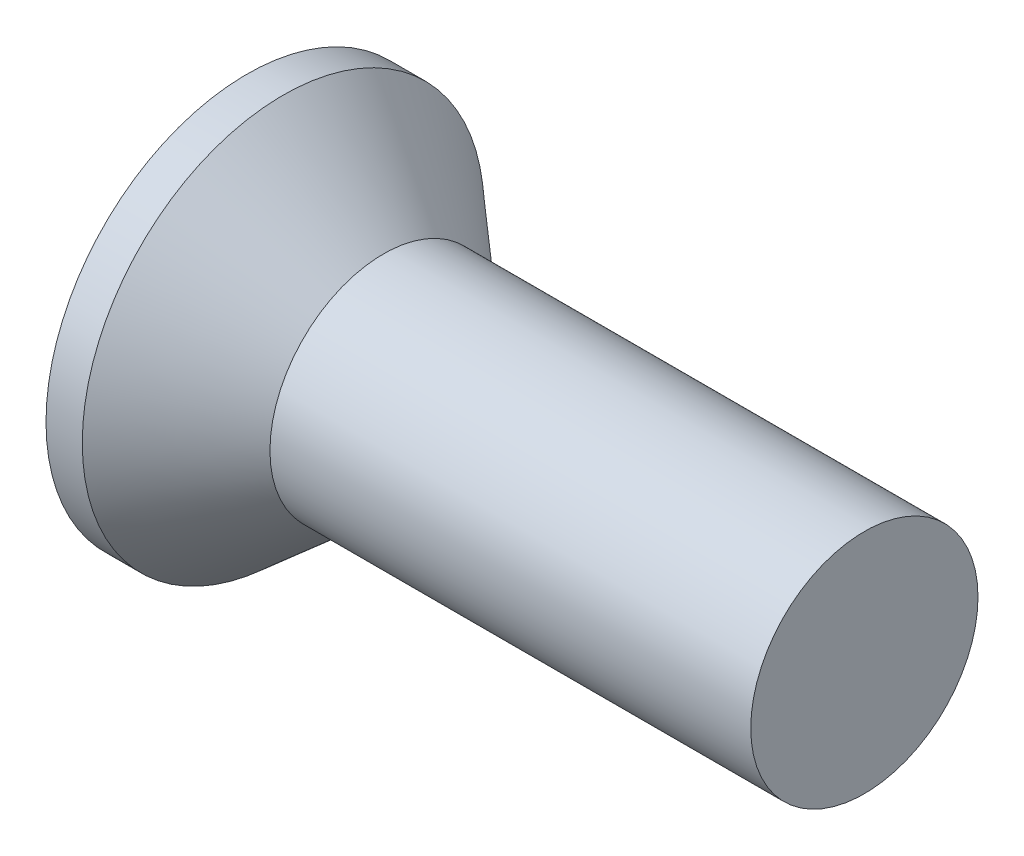
ISO-10303-21;
HEADER;
FILE_DESCRIPTION(('STEP AP214'),'2;1');
FILE_NAME('part.step','',(''),(''),'','','');
FILE_SCHEMA(('AUTOMOTIVE_DESIGN { 1 0 10303 214 1 1 1 1 }'));
ENDSEC;
DATA;
#1=APPLICATION_CONTEXT('core data for automotive mechanical design processes');
#2=APPLICATION_PROTOCOL_DEFINITION('international standard','automotive_design',2000,#1);
#3=PRODUCT_CONTEXT('',#1,'mechanical');
#4=PRODUCT('Part','Part','',(#3));
#5=PRODUCT_RELATED_PRODUCT_CATEGORY('part','',(#4));
#6=PRODUCT_DEFINITION_FORMATION('','',#4);
#7=PRODUCT_DEFINITION_CONTEXT('part definition',#1,'design');
#8=PRODUCT_DEFINITION('design','',#6,#7);
#9=PRODUCT_DEFINITION_SHAPE('','',#8);
#10=(LENGTH_UNIT() NAMED_UNIT(*) SI_UNIT(.MILLI.,.METRE.));
#11=(NAMED_UNIT(*) PLANE_ANGLE_UNIT() SI_UNIT($,.RADIAN.));
#12=(NAMED_UNIT(*) SI_UNIT($,.STERADIAN.) SOLID_ANGLE_UNIT());
#13=UNCERTAINTY_MEASURE_WITH_UNIT(LENGTH_MEASURE(1.E-05),#10,'distance_accuracy_value','');
#14=(GEOMETRIC_REPRESENTATION_CONTEXT(3) GLOBAL_UNCERTAINTY_ASSIGNED_CONTEXT((#13)) GLOBAL_UNIT_ASSIGNED_CONTEXT((#10,
#11,#12)) REPRESENTATION_CONTEXT('',''));
#15=CARTESIAN_POINT('',(0.,0.,0.));
#16=DIRECTION('',(0.,0.,1.));
#17=DIRECTION('',(1.,0.,0.));
#18=AXIS2_PLACEMENT_3D('',#15,#16,#17);
#19=CARTESIAN_POINT('',(0.,0.,0.));
#20=DIRECTION('',(-1.,0.,0.));
#21=DIRECTION('',(0.,0.,1.));
#22=AXIS2_PLACEMENT_3D('',#19,#20,#21);
#23=PLANE('',#22);
#24=CARTESIAN_POINT('',(0.,0.,0.));
#25=DIRECTION('',(-1.,0.,0.));
#26=DIRECTION('',(0.,0.,1.));
#27=AXIS2_PLACEMENT_3D('',#24,#25,#26);
#28=CIRCLE('',#27,3.0988);
#29=CARTESIAN_POINT('',(0.,0.,3.0988));
#30=VERTEX_POINT('',#29);
#31=EDGE_CURVE('E39',#30,#30,#28,.T.);
#32=ORIENTED_EDGE('',*,*,#31,.T.);
#33=EDGE_LOOP('',(#32));
#34=FACE_BOUND('',#33,.T.);
#35=DIRECTION('',(0.,1.,0.));
#36=VECTOR('',#35,1.);
#37=CARTESIAN_POINT('',(0.,-2.4765,-0.482599999999999));
#38=LINE('',#37,#36);
#39=CARTESIAN_POINT('',(0.,-2.4765,-0.482599999999999));
#40=VERTEX_POINT('',#39);
#41=CARTESIAN_POINT('',(0.,-0.482599999999998,-0.482599999999999));
#42=VERTEX_POINT('',#41);
#43=EDGE_CURVE('E100',#40,#42,#38,.T.);
#44=ORIENTED_EDGE('',*,*,#43,.T.);
#45=DIRECTION('',(0.,0.,-1.));
#46=VECTOR('',#45,1.);
#47=CARTESIAN_POINT('',(0.,-0.482600000000008,2.4765));
#48=LINE('',#47,#46);
#49=CARTESIAN_POINT('',(0.,-0.482599999999991,-2.4765));
#50=VERTEX_POINT('',#49);
#51=EDGE_CURVE('E80',#42,#50,#48,.T.);
#52=ORIENTED_EDGE('',*,*,#51,.T.);
#53=DIRECTION('',(0.,1.,0.));
#54=VECTOR('',#53,1.);
#55=CARTESIAN_POINT('',(0.,-0.482599999999991,-2.4765));
#56=LINE('',#55,#54);
#57=CARTESIAN_POINT('',(0.,0.482600000000008,-2.4765));
#58=VERTEX_POINT('',#57);
#59=EDGE_CURVE('E335',#50,#58,#56,.T.);
#60=ORIENTED_EDGE('',*,*,#59,.T.);
#61=DIRECTION('',(0.,0.,1.));
#62=VECTOR('',#61,1.);
#63=CARTESIAN_POINT('',(0.,0.482600000000008,-2.4765));
#64=LINE('',#63,#62);
#65=CARTESIAN_POINT('',(0.,0.482600000000001,-0.482599999999999));
#66=VERTEX_POINT('',#65);
#67=EDGE_CURVE('E96',#58,#66,#64,.T.);
#68=ORIENTED_EDGE('',*,*,#67,.T.);
#69=CARTESIAN_POINT('',(0.,2.4765,-0.482599999999999));
#70=VERTEX_POINT('',#69);
#71=EDGE_CURVE('E90',#66,#70,#38,.T.);
#72=ORIENTED_EDGE('',*,*,#71,.T.);
#73=DIRECTION('',(0.,0.,1.));
#74=VECTOR('',#73,1.);
#75=CARTESIAN_POINT('',(0.,2.4765,-0.482599999999999));
#76=LINE('',#75,#74);
#77=CARTESIAN_POINT('',(0.,2.4765,0.482599999999999));
#78=VERTEX_POINT('',#77);
#79=EDGE_CURVE('E93',#70,#78,#76,.T.);
#80=ORIENTED_EDGE('',*,*,#79,.T.);
#81=DIRECTION('',(0.,-1.,0.));
#82=VECTOR('',#81,1.);
#83=CARTESIAN_POINT('',(0.,2.4765,0.482599999999999));
#84=LINE('',#83,#82);
#85=CARTESIAN_POINT('',(0.,0.482599999999997,0.4826));
#86=VERTEX_POINT('',#85);
#87=EDGE_CURVE('E347',#78,#86,#84,.T.);
#88=ORIENTED_EDGE('',*,*,#87,.T.);
#89=CARTESIAN_POINT('',(0.,0.48259999999999,2.4765));
#90=VERTEX_POINT('',#89);
#91=EDGE_CURVE('E330',#86,#90,#64,.T.);
#92=ORIENTED_EDGE('',*,*,#91,.T.);
#93=DIRECTION('',(0.,-1.,0.));
#94=VECTOR('',#93,1.);
#95=CARTESIAN_POINT('',(0.,0.48259999999999,2.4765));
#96=LINE('',#95,#94);
#97=CARTESIAN_POINT('',(0.,-0.482600000000008,2.4765));
#98=VERTEX_POINT('',#97);
#99=EDGE_CURVE('E316',#90,#98,#96,.T.);
#100=ORIENTED_EDGE('',*,*,#99,.T.);
#101=CARTESIAN_POINT('',(0.,-0.482600000000001,0.4826));
#102=VERTEX_POINT('',#101);
#103=EDGE_CURVE('E328',#98,#102,#48,.T.);
#104=ORIENTED_EDGE('',*,*,#103,.T.);
#105=CARTESIAN_POINT('',(0.,-2.4765,0.4826));
#106=VERTEX_POINT('',#105);
#107=EDGE_CURVE('E106',#102,#106,#84,.T.);
#108=ORIENTED_EDGE('',*,*,#107,.T.);
#109=DIRECTION('',(0.,0.,-1.));
#110=VECTOR('',#109,1.);
#111=CARTESIAN_POINT('',(0.,-2.4765,0.4826));
#112=LINE('',#111,#110);
#113=EDGE_CURVE('E129',#106,#40,#112,.T.);
#114=ORIENTED_EDGE('',*,*,#113,.T.);
#115=EDGE_LOOP('',(#44,#52,#60,#68,#72,#80,#88,#92,#100,#104,#108,#114));
#116=FACE_BOUND('',#115,.T.);
#117=ADVANCED_FACE('F32',(#34,#116),#23,.T.);
#118=CARTESIAN_POINT('',(3.18005113636364,0.,0.215250568181818));
#119=DIRECTION('',(-0.08377526021447,0.,-0.996484674130013));
#120=DIRECTION('',(-0.996484674130013,0.,0.08377526021447));
#121=AXIS2_PLACEMENT_3D('',#118,#119,#120);
#122=PLANE('',#121);
#123=ORIENTED_EDGE('',*,*,#107,.F.);
#124=DIRECTION('',(0.993006162058238,0.0834828189340999,-0.0834828189340996));
#125=VECTOR('',#124,1.);
#126=CARTESIAN_POINT('',(3.19789518323365,-0.213750404949385,0.213750404949384));
#127=LINE('',#126,#125);
#128=CARTESIAN_POINT('',(2.8702,-0.241300000000001,0.241299999999999));
#129=VERTEX_POINT('',#128);
#130=EDGE_CURVE('E124',#102,#129,#127,.T.);
#131=ORIENTED_EDGE('',*,*,#130,.T.);
#132=DIRECTION('',(0.78724620786628,0.613076692851616,-0.0661844157055722));
#133=VECTOR('',#132,1.);
#134=CARTESIAN_POINT('',(0.,-2.4765,0.4826));
#135=LINE('',#134,#133);
#136=EDGE_CURVE('E101',#106,#129,#135,.T.);
#137=ORIENTED_EDGE('',*,*,#136,.F.);
#138=EDGE_LOOP('',(#123,#131,#137));
#139=FACE_BOUND('',#138,.T.);
#140=ADVANCED_FACE('F152',(#139),#122,.T.);
#141=DIRECTION('',(0.78724620786628,-0.613076692851616,-0.066184415705572));
#142=VECTOR('',#141,1.);
#143=CARTESIAN_POINT('',(0.,2.4765,0.482599999999999));
#144=LINE('',#143,#142);
#145=CARTESIAN_POINT('',(2.8702,0.2413,0.2413));
#146=VERTEX_POINT('',#145);
#147=EDGE_CURVE('E46',#78,#146,#144,.T.);
#148=ORIENTED_EDGE('',*,*,#147,.T.);
#149=DIRECTION('',(-0.993006162058238,0.0834828189340991,0.0834828189340996));
#150=VECTOR('',#149,1.);
#151=CARTESIAN_POINT('',(3.19789518323365,0.213750404949383,0.213750404949384));
#152=LINE('',#151,#150);
#153=EDGE_CURVE('E343',#146,#86,#152,.T.);
#154=ORIENTED_EDGE('',*,*,#153,.T.);
#155=ORIENTED_EDGE('',*,*,#87,.F.);
#156=EDGE_LOOP('',(#148,#154,#155));
#157=FACE_BOUND('',#156,.T.);
#158=ADVANCED_FACE('F156',(#157),#122,.T.);
#159=CARTESIAN_POINT('',(3.18005113636364,0.,-0.215250568181818));
#160=DIRECTION('',(-0.0837752602144698,0.,0.996484674130013));
#161=DIRECTION('',(0.996484674130013,0.,0.0837752602144698));
#162=AXIS2_PLACEMENT_3D('',#159,#160,#161);
#163=PLANE('',#162);
#164=DIRECTION('',(0.78724620786628,0.613076692851616,0.0661844157055719));
#165=VECTOR('',#164,1.);
#166=CARTESIAN_POINT('',(0.,-2.4765,-0.482599999999999));
#167=LINE('',#166,#165);
#168=CARTESIAN_POINT('',(2.8702,-0.241299999999999,-0.241300000000001));
#169=VERTEX_POINT('',#168);
#170=EDGE_CURVE('E55',#40,#169,#167,.T.);
#171=ORIENTED_EDGE('',*,*,#170,.T.);
#172=DIRECTION('',(-0.993006162058238,-0.0834828189340993,-0.0834828189340994));
#173=VECTOR('',#172,1.);
#174=CARTESIAN_POINT('',(3.19789518323364,-0.213750404949383,-0.213750404949384));
#175=LINE('',#174,#173);
#176=EDGE_CURVE('E11',#169,#42,#175,.T.);
#177=ORIENTED_EDGE('',*,*,#176,.T.);
#178=ORIENTED_EDGE('',*,*,#43,.F.);
#179=EDGE_LOOP('',(#171,#177,#178));
#180=FACE_BOUND('',#179,.T.);
#181=ADVANCED_FACE('F149',(#180),#163,.T.);
#182=ORIENTED_EDGE('',*,*,#71,.F.);
#183=DIRECTION('',(0.993006162058238,-0.0834828189340997,0.0834828189340994));
#184=VECTOR('',#183,1.);
#185=CARTESIAN_POINT('',(3.19789518323364,0.213750404949385,-0.213750404949384));
#186=LINE('',#185,#184);
#187=CARTESIAN_POINT('',(2.8702,0.2413,-0.2413));
#188=VERTEX_POINT('',#187);
#189=EDGE_CURVE('E109',#66,#188,#186,.T.);
#190=ORIENTED_EDGE('',*,*,#189,.T.);
#191=DIRECTION('',(0.78724620786628,-0.613076692851616,0.0661844157055719));
#192=VECTOR('',#191,1.);
#193=CARTESIAN_POINT('',(0.,2.4765,-0.482599999999999));
#194=LINE('',#193,#192);
#195=EDGE_CURVE('E105',#70,#188,#194,.T.);
#196=ORIENTED_EDGE('',*,*,#195,.F.);
#197=EDGE_LOOP('',(#182,#190,#196));
#198=FACE_BOUND('',#197,.T.);
#199=ADVANCED_FACE('F108',(#198),#163,.T.);
#200=CARTESIAN_POINT('',(-6.34999999999999,0.,0.));
#201=DIRECTION('',(-1.,0.,0.));
#202=DIRECTION('',(0.,0.,1.));
#203=AXIS2_PLACEMENT_3D('',#200,#201,#202);
#204=CYLINDRICAL_SURFACE('',#203,3.0988);
#205=CARTESIAN_POINT('',(0.559574050199084,0.,0.));
#206=DIRECTION('',(-1.,0.,0.));
#207=DIRECTION('',(0.,0.,1.));
#208=AXIS2_PLACEMENT_3D('',#205,#206,#207);
#209=CIRCLE('',#208,3.0988);
#210=CARTESIAN_POINT('',(0.559574050199084,0.,3.0988));
#211=VERTEX_POINT('',#210);
#212=EDGE_CURVE('E132',#211,#211,#209,.T.);
#213=ORIENTED_EDGE('',*,*,#212,.T.);
#214=EDGE_LOOP('',(#213));
#215=FACE_BOUND('',#214,.T.);
#216=ORIENTED_EDGE('',*,*,#31,.F.);
#217=EDGE_LOOP('',(#216));
#218=FACE_BOUND('',#217,.T.);
#219=ADVANCED_FACE('F138',(#215,#218),#204,.T.);
#220=CARTESIAN_POINT('',(0.559574050199084,0.,0.));
#221=DIRECTION('',(-1.,0.,0.));
#222=DIRECTION('',(0.,0.,1.));
#223=AXIS2_PLACEMENT_3D('',#220,#221,#222);
#224=CONICAL_SURFACE('',#223,3.0988,0.715584993317677);
#225=CARTESIAN_POINT('',(2.1082,0.,0.));
#226=DIRECTION('',(-1.,0.,0.));
#227=DIRECTION('',(0.,0.,1.));
#228=AXIS2_PLACEMENT_3D('',#225,#226,#227);
#229=CIRCLE('',#228,1.7526);
#230=CARTESIAN_POINT('',(2.1082,0.,1.7526));
#231=VERTEX_POINT('',#230);
#232=EDGE_CURVE('E128',#231,#231,#229,.T.);
#233=ORIENTED_EDGE('',*,*,#232,.T.);
#234=EDGE_LOOP('',(#233));
#235=FACE_BOUND('',#234,.T.);
#236=ORIENTED_EDGE('',*,*,#212,.F.);
#237=EDGE_LOOP('',(#236));
#238=FACE_BOUND('',#237,.T.);
#239=ADVANCED_FACE('F140',(#235,#238),#224,.T.);
#240=CARTESIAN_POINT('',(-6.34999999999999,0.,0.));
#241=DIRECTION('',(-1.,0.,0.));
#242=DIRECTION('',(0.,0.,1.));
#243=AXIS2_PLACEMENT_3D('',#240,#241,#242);
#244=CYLINDRICAL_SURFACE('',#243,1.7526);
#245=CARTESIAN_POINT('',(9.525,0.,0.));
#246=DIRECTION('',(-1.,0.,0.));
#247=DIRECTION('',(0.,0.,1.));
#248=AXIS2_PLACEMENT_3D('',#245,#246,#247);
#249=CIRCLE('',#248,1.7526);
#250=CARTESIAN_POINT('',(9.525,0.,1.7526));
#251=VERTEX_POINT('',#250);
#252=EDGE_CURVE('E125',#251,#251,#249,.T.);
#253=ORIENTED_EDGE('',*,*,#252,.T.);
#254=EDGE_LOOP('',(#253));
#255=FACE_BOUND('',#254,.T.);
#256=ORIENTED_EDGE('',*,*,#232,.F.);
#257=EDGE_LOOP('',(#256));
#258=FACE_BOUND('',#257,.T.);
#259=ADVANCED_FACE('F146',(#255,#258),#244,.T.);
#260=CARTESIAN_POINT('',(9.525,1.7526,0.));
#261=DIRECTION('',(1.,0.,0.));
#262=DIRECTION('',(0.,0.,-1.));
#263=AXIS2_PLACEMENT_3D('',#260,#261,#262);
#264=PLANE('',#263);
#265=ORIENTED_EDGE('',*,*,#252,.F.);
#266=EDGE_LOOP('',(#265));
#267=FACE_BOUND('',#266,.T.);
#268=ADVANCED_FACE('F176',(#267),#264,.T.);
#269=CARTESIAN_POINT('',(2.8702,0.2413,-0.2413));
#270=DIRECTION('',(1.,0.,0.));
#271=DIRECTION('',(0.,0.,-1.));
#272=AXIS2_PLACEMENT_3D('',#269,#270,#271);
#273=PLANE('',#272);
#274=DIRECTION('',(0.,1.,0.));
#275=VECTOR('',#274,1.);
#276=CARTESIAN_POINT('',(2.8702,-0.2413,-0.2413));
#277=LINE('',#276,#275);
#278=EDGE_CURVE('E120',#169,#188,#277,.T.);
#279=ORIENTED_EDGE('',*,*,#278,.F.);
#280=DIRECTION('',(0.,0.,-1.));
#281=VECTOR('',#280,1.);
#282=CARTESIAN_POINT('',(2.8702,-0.2413,0.2413));
#283=LINE('',#282,#281);
#284=EDGE_CURVE('E111',#129,#169,#283,.T.);
#285=ORIENTED_EDGE('',*,*,#284,.F.);
#286=DIRECTION('',(0.,-1.,0.));
#287=VECTOR('',#286,1.);
#288=CARTESIAN_POINT('',(2.8702,0.2413,0.2413));
#289=LINE('',#288,#287);
#290=EDGE_CURVE('E114',#146,#129,#289,.T.);
#291=ORIENTED_EDGE('',*,*,#290,.F.);
#292=DIRECTION('',(0.,0.,1.));
#293=VECTOR('',#292,1.);
#294=CARTESIAN_POINT('',(2.8702,0.2413,-0.2413));
#295=LINE('',#294,#293);
#296=EDGE_CURVE('E118',#188,#146,#295,.T.);
#297=ORIENTED_EDGE('',*,*,#296,.F.);
#298=EDGE_LOOP('',(#279,#285,#291,#297));
#299=FACE_BOUND('',#298,.T.);
#300=ADVANCED_FACE('F173',(#299),#273,.F.);
#301=CARTESIAN_POINT('',(0.,-2.4765,-0.482599999999999));
#302=DIRECTION('',(-0.614423873827266,0.788976110710012,0.));
#303=DIRECTION('',(-0.788976110710012,-0.614423873827266,0.));
#304=AXIS2_PLACEMENT_3D('',#301,#302,#303);
#305=PLANE('',#304);
#306=ORIENTED_EDGE('',*,*,#170,.F.);
#307=ORIENTED_EDGE('',*,*,#113,.F.);
#308=ORIENTED_EDGE('',*,*,#136,.T.);
#309=ORIENTED_EDGE('',*,*,#284,.T.);
#310=EDGE_LOOP('',(#306,#307,#308,#309));
#311=FACE_BOUND('',#310,.T.);
#312=ADVANCED_FACE('F165',(#311),#305,.T.);
#313=CARTESIAN_POINT('',(2.8702,0.2413,0.2413));
#314=DIRECTION('',(-0.614423873827266,-0.788976110710012,0.));
#315=DIRECTION('',(0.788976110710012,-0.614423873827266,0.));
#316=AXIS2_PLACEMENT_3D('',#313,#314,#315);
#317=PLANE('',#316);
#318=ORIENTED_EDGE('',*,*,#147,.F.);
#319=ORIENTED_EDGE('',*,*,#79,.F.);
#320=ORIENTED_EDGE('',*,*,#195,.T.);
#321=ORIENTED_EDGE('',*,*,#296,.T.);
#322=EDGE_LOOP('',(#318,#319,#320,#321));
#323=FACE_BOUND('',#322,.T.);
#324=ADVANCED_FACE('F104',(#323),#317,.T.);
#325=CARTESIAN_POINT('',(3.18005113636364,-0.215250568181818,0.));
#326=DIRECTION('',(-0.08377526021447,0.996484674130013,0.));
#327=DIRECTION('',(-0.996484674130013,-0.08377526021447,0.));
#328=AXIS2_PLACEMENT_3D('',#325,#326,#327);
#329=PLANE('',#328);
#330=DIRECTION('',(0.78724620786628,0.06618441570557,0.613076692851616));
#331=VECTOR('',#330,1.);
#332=CARTESIAN_POINT('',(0.,-0.482599999999991,-2.4765));
#333=LINE('',#332,#331);
#334=EDGE_CURVE('E337',#50,#169,#333,.T.);
#335=ORIENTED_EDGE('',*,*,#334,.F.);
#336=ORIENTED_EDGE('',*,*,#51,.F.);
#337=ORIENTED_EDGE('',*,*,#176,.F.);
#338=EDGE_LOOP('',(#335,#336,#337));
#339=FACE_BOUND('',#338,.T.);
#340=ADVANCED_FACE('F172',(#339),#329,.T.);
#341=CARTESIAN_POINT('',(3.18005113636364,0.215250568181818,0.));
#342=DIRECTION('',(-0.0837752602144698,-0.996484674130013,0.));
#343=DIRECTION('',(0.996484674130013,-0.0837752602144698,0.));
#344=AXIS2_PLACEMENT_3D('',#341,#342,#343);
#345=PLANE('',#344);
#346=ORIENTED_EDGE('',*,*,#67,.F.);
#347=DIRECTION('',(0.78724620786628,-0.0661844157055741,0.613076692851616));
#348=VECTOR('',#347,1.);
#349=CARTESIAN_POINT('',(0.,0.482600000000008,-2.4765));
#350=LINE('',#349,#348);
#351=EDGE_CURVE('E71',#58,#188,#350,.T.);
#352=ORIENTED_EDGE('',*,*,#351,.T.);
#353=ORIENTED_EDGE('',*,*,#189,.F.);
#354=EDGE_LOOP('',(#346,#352,#353));
#355=FACE_BOUND('',#354,.T.);
#356=ADVANCED_FACE('F216',(#355),#345,.T.);
#357=CARTESIAN_POINT('',(0.,0.482600000000008,-2.4765));
#358=DIRECTION('',(-0.614423873827266,0.,0.788976110710012));
#359=DIRECTION('',(-0.788976110710012,0.,-0.614423873827266));
#360=AXIS2_PLACEMENT_3D('',#357,#358,#359);
#361=PLANE('',#360);
#362=ORIENTED_EDGE('',*,*,#351,.F.);
#363=ORIENTED_EDGE('',*,*,#59,.F.);
#364=ORIENTED_EDGE('',*,*,#334,.T.);
#365=ORIENTED_EDGE('',*,*,#278,.T.);
#366=EDGE_LOOP('',(#362,#363,#364,#365));
#367=FACE_BOUND('',#366,.T.);
#368=ADVANCED_FACE('F224',(#367),#361,.T.);
#369=ORIENTED_EDGE('',*,*,#103,.F.);
#370=DIRECTION('',(0.78724620786628,0.0661844157055742,-0.613076692851616));
#371=VECTOR('',#370,1.);
#372=CARTESIAN_POINT('',(0.,-0.482600000000008,2.4765));
#373=LINE('',#372,#371);
#374=EDGE_CURVE('E313',#98,#129,#373,.T.);
#375=ORIENTED_EDGE('',*,*,#374,.T.);
#376=ORIENTED_EDGE('',*,*,#130,.F.);
#377=EDGE_LOOP('',(#369,#375,#376));
#378=FACE_BOUND('',#377,.T.);
#379=ADVANCED_FACE('F218',(#378),#329,.T.);
#380=DIRECTION('',(0.78724620786628,-0.0661844157055698,-0.613076692851616));
#381=VECTOR('',#380,1.);
#382=CARTESIAN_POINT('',(0.,0.48259999999999,2.4765));
#383=LINE('',#382,#381);
#384=EDGE_CURVE('E324',#90,#146,#383,.T.);
#385=ORIENTED_EDGE('',*,*,#384,.F.);
#386=ORIENTED_EDGE('',*,*,#91,.F.);
#387=ORIENTED_EDGE('',*,*,#153,.F.);
#388=EDGE_LOOP('',(#385,#386,#387));
#389=FACE_BOUND('',#388,.T.);
#390=ADVANCED_FACE('F226',(#389),#345,.T.);
#391=CARTESIAN_POINT('',(2.8702,-0.241300000000001,0.241299999999999));
#392=DIRECTION('',(-0.614423873827266,0.,-0.788976110710012));
#393=DIRECTION('',(0.788976110710012,0.,-0.614423873827266));
#394=AXIS2_PLACEMENT_3D('',#391,#392,#393);
#395=PLANE('',#394);
#396=ORIENTED_EDGE('',*,*,#374,.F.);
#397=ORIENTED_EDGE('',*,*,#99,.F.);
#398=ORIENTED_EDGE('',*,*,#384,.T.);
#399=ORIENTED_EDGE('',*,*,#290,.T.);
#400=EDGE_LOOP('',(#396,#397,#398,#399));
#401=FACE_BOUND('',#400,.T.);
#402=ADVANCED_FACE('F245',(#401),#395,.T.);
#403=CLOSED_SHELL('',(#117,#140,#158,#181,#199,#219,#239,#259,#268,#300,#312,#324,#340,#356,
#368,#379,#390,#402));
#404=MANIFOLD_SOLID_BREP('B2',#403);
#405=ADVANCED_BREP_SHAPE_REPRESENTATION('',(#18,#404),#14);
#406=SHAPE_DEFINITION_REPRESENTATION(#9,#405);
ENDSEC;
END-ISO-10303-21;
